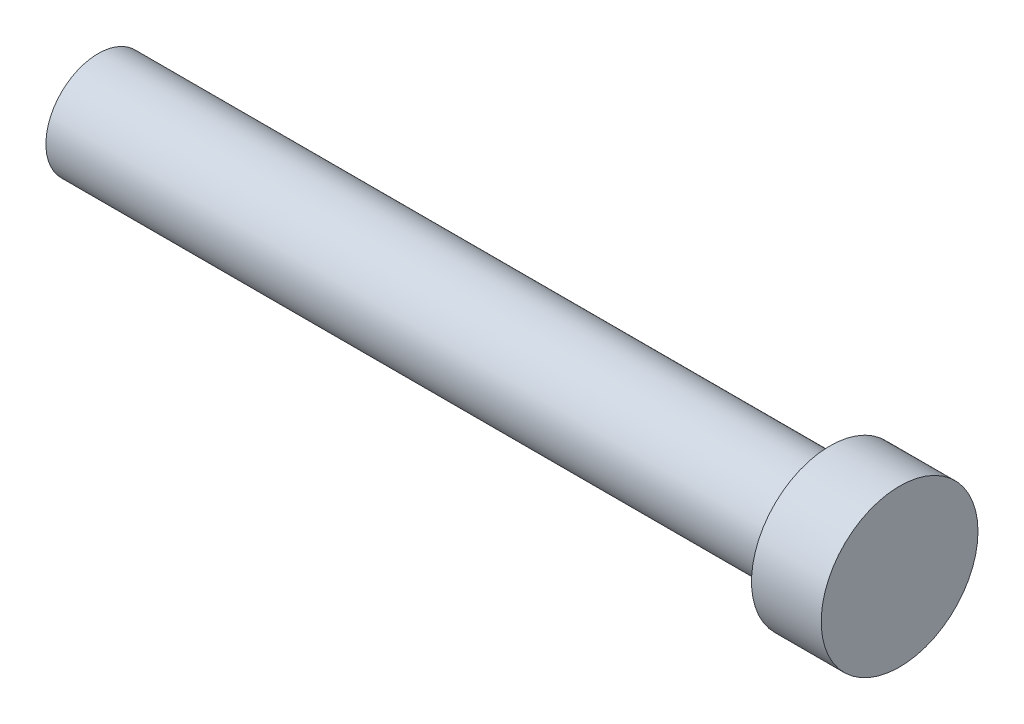
ISO-10303-21;
HEADER;
FILE_DESCRIPTION(('STEP AP214'),'2;1');
FILE_NAME('part.step','',(''),(''),'','','');
FILE_SCHEMA(('AUTOMOTIVE_DESIGN { 1 0 10303 214 1 1 1 1 }'));
ENDSEC;
DATA;
#1=APPLICATION_CONTEXT('core data for automotive mechanical design processes');
#2=APPLICATION_PROTOCOL_DEFINITION('international standard','automotive_design',2000,#1);
#3=PRODUCT_CONTEXT('',#1,'mechanical');
#4=PRODUCT('Part','Part','',(#3));
#5=PRODUCT_RELATED_PRODUCT_CATEGORY('part','',(#4));
#6=PRODUCT_DEFINITION_FORMATION('','',#4);
#7=PRODUCT_DEFINITION_CONTEXT('part definition',#1,'design');
#8=PRODUCT_DEFINITION('design','',#6,#7);
#9=PRODUCT_DEFINITION_SHAPE('','',#8);
#10=(LENGTH_UNIT() NAMED_UNIT(*) SI_UNIT(.MILLI.,.METRE.));
#11=(NAMED_UNIT(*) PLANE_ANGLE_UNIT() SI_UNIT($,.RADIAN.));
#12=(NAMED_UNIT(*) SI_UNIT($,.STERADIAN.) SOLID_ANGLE_UNIT());
#13=UNCERTAINTY_MEASURE_WITH_UNIT(LENGTH_MEASURE(1.E-05),#10,'distance_accuracy_value','');
#14=(GEOMETRIC_REPRESENTATION_CONTEXT(3) GLOBAL_UNCERTAINTY_ASSIGNED_CONTEXT((#13)) GLOBAL_UNIT_ASSIGNED_CONTEXT((#10,
#11,#12)) REPRESENTATION_CONTEXT('',''));
#15=CARTESIAN_POINT('',(0.,0.,0.));
#16=DIRECTION('',(0.,0.,1.));
#17=DIRECTION('',(1.,0.,0.));
#18=AXIS2_PLACEMENT_3D('',#15,#16,#17);
#19=CARTESIAN_POINT('',(210.,0.,0.));
#20=DIRECTION('',(-1.,0.,0.));
#21=DIRECTION('',(0.,0.,1.));
#22=AXIS2_PLACEMENT_3D('',#19,#20,#21);
#23=CYLINDRICAL_SURFACE('',#22,15.);
#24=CARTESIAN_POINT('',(210.,0.,0.));
#25=DIRECTION('',(1.,0.,0.));
#26=DIRECTION('',(0.,0.,-1.));
#27=AXIS2_PLACEMENT_3D('',#24,#25,#26);
#28=CIRCLE('',#27,15.);
#29=CARTESIAN_POINT('',(210.,0.,-15.));
#30=VERTEX_POINT('',#29);
#31=EDGE_CURVE('E10',#30,#30,#28,.T.);
#32=ORIENTED_EDGE('',*,*,#31,.F.);
#33=EDGE_LOOP('',(#32));
#34=FACE_BOUND('',#33,.T.);
#35=CARTESIAN_POINT('',(0.,0.,0.));
#36=DIRECTION('',(1.,0.,0.));
#37=DIRECTION('',(0.,0.,-1.));
#38=AXIS2_PLACEMENT_3D('',#35,#36,#37);
#39=CIRCLE('',#38,15.);
#40=CARTESIAN_POINT('',(0.,0.,-15.));
#41=VERTEX_POINT('',#40);
#42=EDGE_CURVE('E38',#41,#41,#39,.T.);
#43=ORIENTED_EDGE('',*,*,#42,.T.);
#44=EDGE_LOOP('',(#43));
#45=FACE_BOUND('',#44,.T.);
#46=ADVANCED_FACE('F35',(#34,#45),#23,.T.);
#47=CARTESIAN_POINT('',(0.,0.,0.));
#48=DIRECTION('',(1.,0.,0.));
#49=DIRECTION('',(0.,0.,-1.));
#50=AXIS2_PLACEMENT_3D('',#47,#48,#49);
#51=PLANE('',#50);
#52=ORIENTED_EDGE('',*,*,#42,.F.);
#53=EDGE_LOOP('',(#52));
#54=FACE_BOUND('',#53,.T.);
#55=ADVANCED_FACE('F58',(#54),#51,.F.);
#56=CARTESIAN_POINT('',(230.,0.,0.));
#57=DIRECTION('',(-1.,0.,0.));
#58=DIRECTION('',(0.,0.,1.));
#59=AXIS2_PLACEMENT_3D('',#56,#57,#58);
#60=CYLINDRICAL_SURFACE('',#59,22.5);
#61=CARTESIAN_POINT('',(230.,0.,0.));
#62=DIRECTION('',(1.,0.,0.));
#63=DIRECTION('',(0.,0.,-1.));
#64=AXIS2_PLACEMENT_3D('',#61,#62,#63);
#65=CIRCLE('',#64,22.5);
#66=CARTESIAN_POINT('',(230.,0.,-22.5));
#67=VERTEX_POINT('',#66);
#68=EDGE_CURVE('E45',#67,#67,#65,.T.);
#69=ORIENTED_EDGE('',*,*,#68,.F.);
#70=EDGE_LOOP('',(#69));
#71=FACE_BOUND('',#70,.T.);
#72=CARTESIAN_POINT('',(210.,0.,0.));
#73=DIRECTION('',(1.,0.,0.));
#74=DIRECTION('',(0.,0.,-1.));
#75=AXIS2_PLACEMENT_3D('',#72,#73,#74);
#76=CIRCLE('',#75,22.5);
#77=CARTESIAN_POINT('',(210.,0.,-22.5));
#78=VERTEX_POINT('',#77);
#79=EDGE_CURVE('E47',#78,#78,#76,.T.);
#80=ORIENTED_EDGE('',*,*,#79,.T.);
#81=EDGE_LOOP('',(#80));
#82=FACE_BOUND('',#81,.T.);
#83=ADVANCED_FACE('F55',(#71,#82),#60,.T.);
#84=CARTESIAN_POINT('',(230.,0.,0.));
#85=DIRECTION('',(1.,0.,0.));
#86=DIRECTION('',(0.,0.,-1.));
#87=AXIS2_PLACEMENT_3D('',#84,#85,#86);
#88=PLANE('',#87);
#89=ORIENTED_EDGE('',*,*,#68,.T.);
#90=EDGE_LOOP('',(#89));
#91=FACE_BOUND('',#90,.T.);
#92=ADVANCED_FACE('F53',(#91),#88,.T.);
#93=CARTESIAN_POINT('',(210.,0.,0.));
#94=DIRECTION('',(1.,0.,0.));
#95=DIRECTION('',(0.,0.,-1.));
#96=AXIS2_PLACEMENT_3D('',#93,#94,#95);
#97=PLANE('',#96);
#98=ORIENTED_EDGE('',*,*,#31,.T.);
#99=EDGE_LOOP('',(#98));
#100=FACE_BOUND('',#99,.T.);
#101=ORIENTED_EDGE('',*,*,#79,.F.);
#102=EDGE_LOOP('',(#101));
#103=FACE_BOUND('',#102,.T.);
#104=ADVANCED_FACE('F62',(#100,#103),#97,.F.);
#105=CLOSED_SHELL('',(#46,#55,#83,#92,#104));
#106=MANIFOLD_SOLID_BREP('B2',#105);
#107=ADVANCED_BREP_SHAPE_REPRESENTATION('',(#18,#106),#14);
#108=SHAPE_DEFINITION_REPRESENTATION(#9,#107);
ENDSEC;
END-ISO-10303-21;
